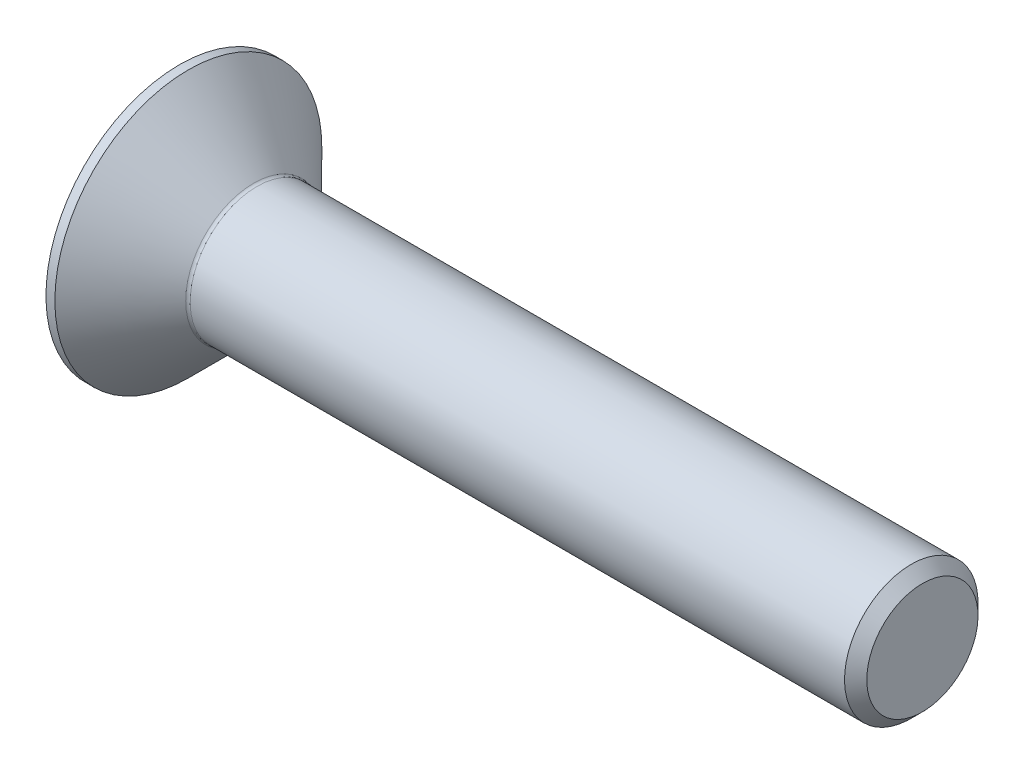
ISO-10303-21;
HEADER;
FILE_DESCRIPTION(('STEP AP214'),'2;1');
FILE_NAME('part.step','',(''),(''),'','','');
FILE_SCHEMA(('AUTOMOTIVE_DESIGN { 1 0 10303 214 1 1 1 1 }'));
ENDSEC;
DATA;
#1=APPLICATION_CONTEXT('core data for automotive mechanical design processes');
#2=APPLICATION_PROTOCOL_DEFINITION('international standard','automotive_design',2000,#1);
#3=PRODUCT_CONTEXT('',#1,'mechanical');
#4=PRODUCT('Part','Part','',(#3));
#5=PRODUCT_RELATED_PRODUCT_CATEGORY('part','',(#4));
#6=PRODUCT_DEFINITION_FORMATION('','',#4);
#7=PRODUCT_DEFINITION_CONTEXT('part definition',#1,'design');
#8=PRODUCT_DEFINITION('design','',#6,#7);
#9=PRODUCT_DEFINITION_SHAPE('','',#8);
#10=(LENGTH_UNIT() NAMED_UNIT(*) SI_UNIT(.MILLI.,.METRE.));
#11=(NAMED_UNIT(*) PLANE_ANGLE_UNIT() SI_UNIT($,.RADIAN.));
#12=(NAMED_UNIT(*) SI_UNIT($,.STERADIAN.) SOLID_ANGLE_UNIT());
#13=UNCERTAINTY_MEASURE_WITH_UNIT(LENGTH_MEASURE(1.E-05),#10,'distance_accuracy_value','');
#14=(GEOMETRIC_REPRESENTATION_CONTEXT(3) GLOBAL_UNCERTAINTY_ASSIGNED_CONTEXT((#13)) GLOBAL_UNIT_ASSIGNED_CONTEXT((#10,
#11,#12)) REPRESENTATION_CONTEXT('',''));
#15=CARTESIAN_POINT('',(0.,0.,0.));
#16=DIRECTION('',(0.,0.,1.));
#17=DIRECTION('',(1.,0.,0.));
#18=AXIS2_PLACEMENT_3D('',#15,#16,#17);
#19=CARTESIAN_POINT('',(0.,0.,0.));
#20=DIRECTION('',(1.,0.,0.));
#21=DIRECTION('',(0.,1.,0.));
#22=AXIS2_PLACEMENT_3D('',#19,#20,#21);
#23=CYLINDRICAL_SURFACE('',#22,3.);
#24=CARTESIAN_POINT('',(0.,0.,0.));
#25=DIRECTION('',(1.,0.,0.));
#26=DIRECTION('',(0.,1.,0.));
#27=AXIS2_PLACEMENT_3D('',#24,#25,#26);
#28=CIRCLE('',#27,3.);
#29=CARTESIAN_POINT('',(0.,3.,0.));
#30=VERTEX_POINT('',#29);
#31=EDGE_CURVE('E145',#30,#30,#28,.T.);
#32=ORIENTED_EDGE('',*,*,#31,.T.);
#33=EDGE_LOOP('',(#32));
#34=FACE_BOUND('',#33,.T.);
#35=CARTESIAN_POINT('',(0.200000000120329,0.,0.));
#36=DIRECTION('',(1.,0.,0.));
#37=DIRECTION('',(0.,1.,0.));
#38=AXIS2_PLACEMENT_3D('',#35,#36,#37);
#39=CIRCLE('',#38,3.);
#40=CARTESIAN_POINT('',(0.200000000120329,3.,0.));
#41=VERTEX_POINT('',#40);
#42=EDGE_CURVE('E137',#41,#41,#39,.T.);
#43=ORIENTED_EDGE('',*,*,#42,.F.);
#44=EDGE_LOOP('',(#43));
#45=FACE_BOUND('',#44,.T.);
#46=ADVANCED_FACE('F35',(#34,#45),#23,.T.);
#47=CARTESIAN_POINT('',(0.,3.,0.));
#48=DIRECTION('',(-1.,0.,0.));
#49=DIRECTION('',(0.,-1.,0.));
#50=AXIS2_PLACEMENT_3D('',#47,#48,#49);
#51=PLANE('',#50);
#52=DIRECTION('',(0.,-1.,0.));
#53=VECTOR('',#52,1.);
#54=CARTESIAN_POINT('',(0.,0.577350269189626,-1.));
#55=LINE('',#54,#53);
#56=CARTESIAN_POINT('',(0.,0.577350269189626,-1.));
#57=VERTEX_POINT('',#56);
#58=CARTESIAN_POINT('',(0.,-0.577350269189625,-1.));
#59=VERTEX_POINT('',#58);
#60=EDGE_CURVE('E50',#57,#59,#55,.T.);
#61=ORIENTED_EDGE('',*,*,#60,.F.);
#62=DIRECTION('',(0.,-0.499999999999999,-0.866025403784439));
#63=VECTOR('',#62,1.);
#64=CARTESIAN_POINT('',(0.,1.15470053837925,0.));
#65=LINE('',#64,#63);
#66=CARTESIAN_POINT('',(0.,1.15470053837925,0.));
#67=VERTEX_POINT('',#66);
#68=EDGE_CURVE('E133',#67,#57,#65,.T.);
#69=ORIENTED_EDGE('',*,*,#68,.F.);
#70=DIRECTION('',(0.,0.499999999999999,-0.866025403784439));
#71=VECTOR('',#70,1.);
#72=CARTESIAN_POINT('',(0.,0.577350269189626,1.));
#73=LINE('',#72,#71);
#74=CARTESIAN_POINT('',(0.,0.577350269189626,1.));
#75=VERTEX_POINT('',#74);
#76=EDGE_CURVE('E131',#75,#67,#73,.T.);
#77=ORIENTED_EDGE('',*,*,#76,.F.);
#78=DIRECTION('',(0.,1.,0.));
#79=VECTOR('',#78,1.);
#80=CARTESIAN_POINT('',(0.,-0.577350269189626,1.));
#81=LINE('',#80,#79);
#82=CARTESIAN_POINT('',(0.,-0.577350269189626,1.));
#83=VERTEX_POINT('',#82);
#84=EDGE_CURVE('E98',#83,#75,#81,.T.);
#85=ORIENTED_EDGE('',*,*,#84,.F.);
#86=DIRECTION('',(0.,0.499999999999999,0.866025403784439));
#87=VECTOR('',#86,1.);
#88=CARTESIAN_POINT('',(0.,-1.15470053837925,0.));
#89=LINE('',#88,#87);
#90=CARTESIAN_POINT('',(0.,-1.15470053837925,0.));
#91=VERTEX_POINT('',#90);
#92=EDGE_CURVE('E127',#91,#83,#89,.T.);
#93=ORIENTED_EDGE('',*,*,#92,.F.);
#94=DIRECTION('',(0.,-0.499999999999999,0.866025403784439));
#95=VECTOR('',#94,1.);
#96=CARTESIAN_POINT('',(0.,-0.577350269189626,-1.));
#97=LINE('',#96,#95);
#98=EDGE_CURVE('E124',#59,#91,#97,.T.);
#99=ORIENTED_EDGE('',*,*,#98,.F.);
#100=EDGE_LOOP('',(#61,#69,#77,#85,#93,#99));
#101=FACE_BOUND('',#100,.T.);
#102=ORIENTED_EDGE('',*,*,#31,.F.);
#103=EDGE_LOOP('',(#102));
#104=FACE_BOUND('',#103,.T.);
#105=ADVANCED_FACE('F168',(#101,#104),#51,.T.);
#106=CARTESIAN_POINT('',(16.7000000001062,0.,0.));
#107=DIRECTION('',(1.,0.,0.));
#108=DIRECTION('',(0.,1.,0.));
#109=AXIS2_PLACEMENT_3D('',#106,#107,#108);
#110=PLANE('',#109);
#111=CARTESIAN_POINT('',(16.7000000001062,0.,0.));
#112=DIRECTION('',(1.,0.,0.));
#113=DIRECTION('',(0.,1.,0.));
#114=AXIS2_PLACEMENT_3D('',#111,#112,#113);
#115=CIRCLE('',#114,1.25000000000865);
#116=CARTESIAN_POINT('',(16.7000000001062,1.25000000000865,0.));
#117=VERTEX_POINT('',#116);
#118=EDGE_CURVE('E148',#117,#117,#115,.T.);
#119=ORIENTED_EDGE('',*,*,#118,.T.);
#120=EDGE_LOOP('',(#119));
#121=FACE_BOUND('',#120,.T.);
#122=ADVANCED_FACE('F174',(#121),#110,.T.);
#123=CARTESIAN_POINT('',(0.,0.,0.));
#124=DIRECTION('',(1.,0.,0.));
#125=DIRECTION('',(0.,1.,0.));
#126=AXIS2_PLACEMENT_3D('',#123,#124,#125);
#127=CYLINDRICAL_SURFACE('',#126,1.5000000000141);
#128=CARTESIAN_POINT('',(1.74142135634354,0.,0.));
#129=DIRECTION('',(1.,0.,0.));
#130=DIRECTION('',(0.,1.,0.));
#131=AXIS2_PLACEMENT_3D('',#128,#129,#130);
#132=CIRCLE('',#131,1.5000000000141);
#133=CARTESIAN_POINT('',(1.74142135634354,1.5000000000141,0.));
#134=VERTEX_POINT('',#133);
#135=EDGE_CURVE('E43',#134,#134,#132,.T.);
#136=ORIENTED_EDGE('',*,*,#135,.T.);
#137=EDGE_LOOP('',(#136));
#138=FACE_BOUND('',#137,.T.);
#139=CARTESIAN_POINT('',(16.4500000001576,0.,0.));
#140=DIRECTION('',(1.,0.,0.));
#141=DIRECTION('',(0.,1.,0.));
#142=AXIS2_PLACEMENT_3D('',#139,#140,#141);
#143=CIRCLE('',#142,1.5000000000141);
#144=CARTESIAN_POINT('',(16.4500000001576,1.5000000000141,0.));
#145=VERTEX_POINT('',#144);
#146=EDGE_CURVE('E151',#145,#145,#143,.F.);
#147=ORIENTED_EDGE('',*,*,#146,.T.);
#148=EDGE_LOOP('',(#147));
#149=FACE_BOUND('',#148,.T.);
#150=ADVANCED_FACE('F156',(#138,#149),#127,.T.);
#151=CARTESIAN_POINT('',(1.70000000010623,0.,0.));
#152=DIRECTION('',(-1.,0.,0.));
#153=DIRECTION('',(0.,-1.,0.));
#154=AXIS2_PLACEMENT_3D('',#151,#152,#153);
#155=CONICAL_SURFACE('',#154,1.5000000000141,0.785398163397448);
#156=CARTESIAN_POINT('',(1.67071067822488,0.,0.));
#157=DIRECTION('',(-1.,0.,0.));
#158=DIRECTION('',(0.,-1.,0.));
#159=AXIS2_PLACEMENT_3D('',#156,#157,#158);
#160=CIRCLE('',#159,1.52928932189545);
#161=CARTESIAN_POINT('',(1.67071067822488,-1.52928932189545,0.));
#162=VERTEX_POINT('',#161);
#163=EDGE_CURVE('E11',#162,#162,#160,.T.);
#164=ORIENTED_EDGE('',*,*,#163,.T.);
#165=EDGE_LOOP('',(#164));
#166=FACE_BOUND('',#165,.T.);
#167=ORIENTED_EDGE('',*,*,#42,.T.);
#168=EDGE_LOOP('',(#167));
#169=FACE_BOUND('',#168,.T.);
#170=ADVANCED_FACE('F187',(#166,#169),#155,.T.);
#171=CARTESIAN_POINT('',(1.2,0.577350269189625,-1.));
#172=DIRECTION('',(0.,0.,-1.));
#173=DIRECTION('',(-1.,0.,0.));
#174=AXIS2_PLACEMENT_3D('',#171,#172,#173);
#175=PLANE('',#174);
#176=ORIENTED_EDGE('',*,*,#60,.T.);
#177=DIRECTION('',(-1.,0.,0.));
#178=VECTOR('',#177,1.);
#179=CARTESIAN_POINT('',(1.2,-0.577350269189627,-1.));
#180=LINE('',#179,#178);
#181=CARTESIAN_POINT('',(1.2,-0.577350269189627,-1.));
#182=VERTEX_POINT('',#181);
#183=EDGE_CURVE('E80',#182,#59,#180,.T.);
#184=ORIENTED_EDGE('',*,*,#183,.F.);
#185=DIRECTION('',(0.,-1.,0.));
#186=VECTOR('',#185,1.);
#187=CARTESIAN_POINT('',(1.2,0.577350269189625,-1.));
#188=LINE('',#187,#186);
#189=CARTESIAN_POINT('',(1.2,0.577350269189625,-1.));
#190=VERTEX_POINT('',#189);
#191=EDGE_CURVE('E135',#190,#182,#188,.T.);
#192=ORIENTED_EDGE('',*,*,#191,.F.);
#193=DIRECTION('',(-1.,0.,0.));
#194=VECTOR('',#193,1.);
#195=CARTESIAN_POINT('',(1.2,0.577350269189625,-1.));
#196=LINE('',#195,#194);
#197=EDGE_CURVE('E58',#190,#57,#196,.T.);
#198=ORIENTED_EDGE('',*,*,#197,.T.);
#199=EDGE_LOOP('',(#176,#184,#192,#198));
#200=FACE_BOUND('',#199,.T.);
#201=ADVANCED_FACE('F190',(#200),#175,.F.);
#202=CARTESIAN_POINT('',(1.2,1.15470053837925,0.));
#203=DIRECTION('',(0.,0.866025403784439,-0.499999999999999));
#204=DIRECTION('',(0.,0.499999999999999,0.866025403784439));
#205=AXIS2_PLACEMENT_3D('',#202,#203,#204);
#206=PLANE('',#205);
#207=ORIENTED_EDGE('',*,*,#68,.T.);
#208=ORIENTED_EDGE('',*,*,#197,.F.);
#209=DIRECTION('',(0.,-0.499999999999999,-0.866025403784439));
#210=VECTOR('',#209,1.);
#211=CARTESIAN_POINT('',(1.2,1.15470053837925,0.));
#212=LINE('',#211,#210);
#213=CARTESIAN_POINT('',(1.2,1.15470053837925,0.));
#214=VERTEX_POINT('',#213);
#215=EDGE_CURVE('E110',#214,#190,#212,.T.);
#216=ORIENTED_EDGE('',*,*,#215,.F.);
#217=DIRECTION('',(-1.,0.,0.));
#218=VECTOR('',#217,1.);
#219=CARTESIAN_POINT('',(1.2,1.15470053837925,0.));
#220=LINE('',#219,#218);
#221=EDGE_CURVE('E102',#214,#67,#220,.T.);
#222=ORIENTED_EDGE('',*,*,#221,.T.);
#223=EDGE_LOOP('',(#207,#208,#216,#222));
#224=FACE_BOUND('',#223,.T.);
#225=ADVANCED_FACE('F194',(#224),#206,.F.);
#226=CARTESIAN_POINT('',(1.2,0.577350269189626,1.));
#227=DIRECTION('',(0.,0.866025403784439,0.499999999999999));
#228=DIRECTION('',(0.,-0.499999999999999,0.86602540378444));
#229=AXIS2_PLACEMENT_3D('',#226,#227,#228);
#230=PLANE('',#229);
#231=ORIENTED_EDGE('',*,*,#76,.T.);
#232=ORIENTED_EDGE('',*,*,#221,.F.);
#233=DIRECTION('',(0.,0.499999999999999,-0.866025403784439));
#234=VECTOR('',#233,1.);
#235=CARTESIAN_POINT('',(1.2,0.577350269189626,1.));
#236=LINE('',#235,#234);
#237=CARTESIAN_POINT('',(1.2,0.577350269189626,1.));
#238=VERTEX_POINT('',#237);
#239=EDGE_CURVE('E106',#238,#214,#236,.T.);
#240=ORIENTED_EDGE('',*,*,#239,.F.);
#241=DIRECTION('',(-1.,0.,0.));
#242=VECTOR('',#241,1.);
#243=CARTESIAN_POINT('',(1.2,0.577350269189626,1.));
#244=LINE('',#243,#242);
#245=EDGE_CURVE('E91',#238,#75,#244,.T.);
#246=ORIENTED_EDGE('',*,*,#245,.T.);
#247=EDGE_LOOP('',(#231,#232,#240,#246));
#248=FACE_BOUND('',#247,.T.);
#249=ADVANCED_FACE('F107',(#248),#230,.F.);
#250=CARTESIAN_POINT('',(1.2,-0.577350269189626,1.));
#251=DIRECTION('',(0.,0.,1.));
#252=DIRECTION('',(1.,0.,0.));
#253=AXIS2_PLACEMENT_3D('',#250,#251,#252);
#254=PLANE('',#253);
#255=ORIENTED_EDGE('',*,*,#84,.T.);
#256=ORIENTED_EDGE('',*,*,#245,.F.);
#257=DIRECTION('',(0.,1.,0.));
#258=VECTOR('',#257,1.);
#259=CARTESIAN_POINT('',(1.2,-0.577350269189626,1.));
#260=LINE('',#259,#258);
#261=CARTESIAN_POINT('',(1.2,-0.577350269189626,1.));
#262=VERTEX_POINT('',#261);
#263=EDGE_CURVE('E95',#262,#238,#260,.T.);
#264=ORIENTED_EDGE('',*,*,#263,.F.);
#265=DIRECTION('',(-1.,0.,0.));
#266=VECTOR('',#265,1.);
#267=CARTESIAN_POINT('',(1.2,-0.577350269189626,1.));
#268=LINE('',#267,#266);
#269=EDGE_CURVE('E103',#262,#83,#268,.T.);
#270=ORIENTED_EDGE('',*,*,#269,.T.);
#271=EDGE_LOOP('',(#255,#256,#264,#270));
#272=FACE_BOUND('',#271,.T.);
#273=ADVANCED_FACE('F93',(#272),#254,.F.);
#274=CARTESIAN_POINT('',(1.2,-1.15470053837925,0.));
#275=DIRECTION('',(0.,-0.866025403784439,0.499999999999999));
#276=DIRECTION('',(0.,-0.499999999999999,-0.866025403784439));
#277=AXIS2_PLACEMENT_3D('',#274,#275,#276);
#278=PLANE('',#277);
#279=ORIENTED_EDGE('',*,*,#92,.T.);
#280=ORIENTED_EDGE('',*,*,#269,.F.);
#281=DIRECTION('',(0.,0.499999999999999,0.866025403784439));
#282=VECTOR('',#281,1.);
#283=CARTESIAN_POINT('',(1.2,-1.15470053837925,0.));
#284=LINE('',#283,#282);
#285=CARTESIAN_POINT('',(1.2,-1.15470053837925,0.));
#286=VERTEX_POINT('',#285);
#287=EDGE_CURVE('E116',#286,#262,#284,.T.);
#288=ORIENTED_EDGE('',*,*,#287,.F.);
#289=DIRECTION('',(-1.,0.,0.));
#290=VECTOR('',#289,1.);
#291=CARTESIAN_POINT('',(1.2,-1.15470053837925,0.));
#292=LINE('',#291,#290);
#293=EDGE_CURVE('E140',#286,#91,#292,.T.);
#294=ORIENTED_EDGE('',*,*,#293,.T.);
#295=EDGE_LOOP('',(#279,#280,#288,#294));
#296=FACE_BOUND('',#295,.T.);
#297=ADVANCED_FACE('F198',(#296),#278,.F.);
#298=CARTESIAN_POINT('',(1.2,-0.577350269189627,-1.));
#299=DIRECTION('',(0.,-0.866025403784439,-0.499999999999999));
#300=DIRECTION('',(0.,0.499999999999999,-0.866025403784439));
#301=AXIS2_PLACEMENT_3D('',#298,#299,#300);
#302=PLANE('',#301);
#303=ORIENTED_EDGE('',*,*,#98,.T.);
#304=ORIENTED_EDGE('',*,*,#293,.F.);
#305=DIRECTION('',(0.,-0.499999999999999,0.866025403784439));
#306=VECTOR('',#305,1.);
#307=CARTESIAN_POINT('',(1.2,-0.577350269189627,-1.));
#308=LINE('',#307,#306);
#309=EDGE_CURVE('E118',#182,#286,#308,.T.);
#310=ORIENTED_EDGE('',*,*,#309,.F.);
#311=ORIENTED_EDGE('',*,*,#183,.T.);
#312=EDGE_LOOP('',(#303,#304,#310,#311));
#313=FACE_BOUND('',#312,.T.);
#314=ADVANCED_FACE('F195',(#313),#302,.F.);
#315=CARTESIAN_POINT('',(1.2,0.,0.));
#316=DIRECTION('',(-1.,0.,0.));
#317=DIRECTION('',(0.,-1.,0.));
#318=AXIS2_PLACEMENT_3D('',#315,#316,#317);
#319=PLANE('',#318);
#320=ORIENTED_EDGE('',*,*,#191,.T.);
#321=ORIENTED_EDGE('',*,*,#309,.T.);
#322=ORIENTED_EDGE('',*,*,#287,.T.);
#323=ORIENTED_EDGE('',*,*,#263,.T.);
#324=ORIENTED_EDGE('',*,*,#239,.T.);
#325=ORIENTED_EDGE('',*,*,#215,.T.);
#326=EDGE_LOOP('',(#320,#321,#322,#323,#324,#325));
#327=FACE_BOUND('',#326,.T.);
#328=ADVANCED_FACE('F113',(#327),#319,.T.);
#329=CARTESIAN_POINT('',(16.7000000001062,0.,0.));
#330=DIRECTION('',(-1.,0.,0.));
#331=DIRECTION('',(0.,-1.,0.));
#332=AXIS2_PLACEMENT_3D('',#329,#330,#331);
#333=CONICAL_SURFACE('',#332,1.25000000000865,0.785398163511132);
#334=ORIENTED_EDGE('',*,*,#146,.F.);
#335=EDGE_LOOP('',(#334));
#336=FACE_BOUND('',#335,.T.);
#337=ORIENTED_EDGE('',*,*,#118,.F.);
#338=EDGE_LOOP('',(#337));
#339=FACE_BOUND('',#338,.T.);
#340=ADVANCED_FACE('F160',(#336,#339),#333,.T.);
#341=CARTESIAN_POINT('',(1.74142135634354,0.,0.));
#342=DIRECTION('',(1.,0.,0.));
#343=DIRECTION('',(0.,1.,0.));
#344=AXIS2_PLACEMENT_3D('',#341,#342,#343);
#345=TOROIDAL_SURFACE('',#344,1.6000000000141,0.1);
#346=ORIENTED_EDGE('',*,*,#163,.F.);
#347=EDGE_LOOP('',(#346));
#348=FACE_BOUND('',#347,.T.);
#349=ORIENTED_EDGE('',*,*,#135,.F.);
#350=EDGE_LOOP('',(#349));
#351=FACE_BOUND('',#350,.T.);
#352=ADVANCED_FACE('F37',(#348,#351),#345,.F.);
#353=CLOSED_SHELL('',(#46,#105,#122,#150,#170,#201,#225,#249,#273,#297,#314,#328,#340,#352));
#354=MANIFOLD_SOLID_BREP('B2',#353);
#355=ADVANCED_BREP_SHAPE_REPRESENTATION('',(#18,#354),#14);
#356=SHAPE_DEFINITION_REPRESENTATION(#9,#355);
ENDSEC;
END-ISO-10303-21;
